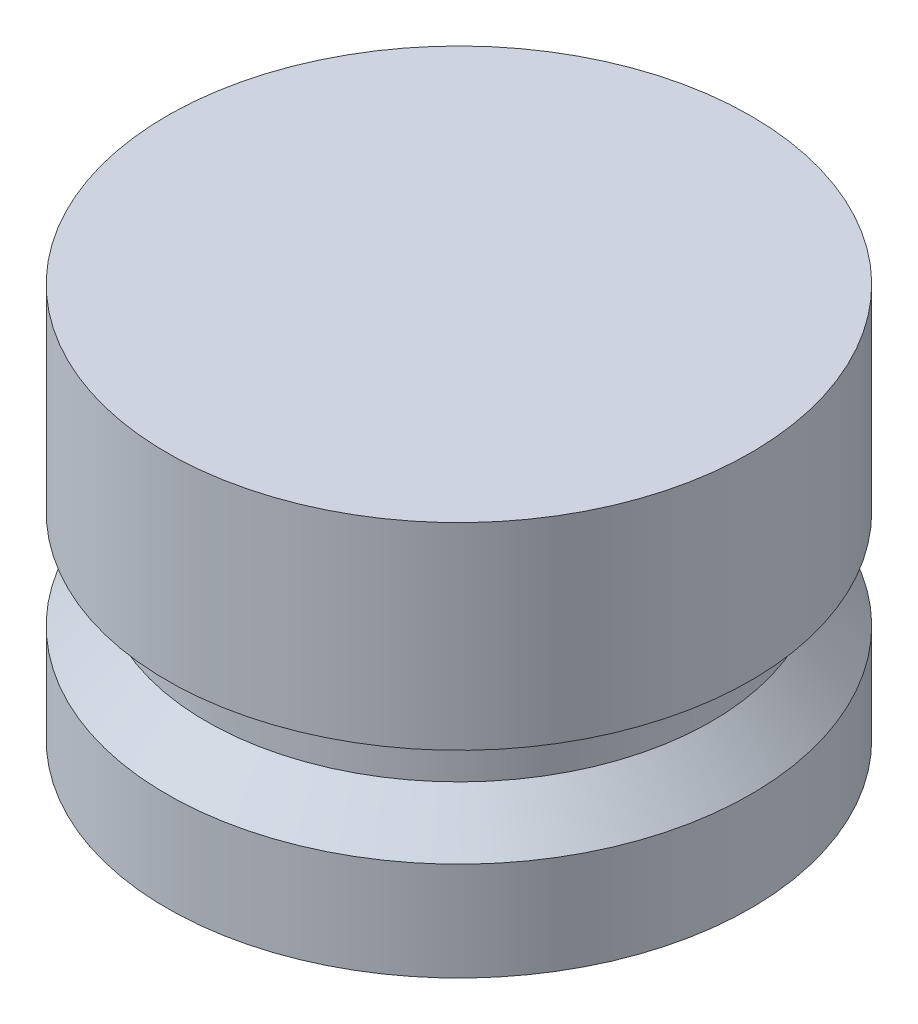
ISO-10303-21;
HEADER;
FILE_DESCRIPTION(('STEP AP214'),'2;1');
FILE_NAME('part.step','',(''),(''),'','','');
FILE_SCHEMA(('AUTOMOTIVE_DESIGN { 1 0 10303 214 1 1 1 1 }'));
ENDSEC;
DATA;
#1=APPLICATION_CONTEXT('core data for automotive mechanical design processes');
#2=APPLICATION_PROTOCOL_DEFINITION('international standard','automotive_design',2000,#1);
#3=PRODUCT_CONTEXT('',#1,'mechanical');
#4=PRODUCT('Part','Part','',(#3));
#5=PRODUCT_RELATED_PRODUCT_CATEGORY('part','',(#4));
#6=PRODUCT_DEFINITION_FORMATION('','',#4);
#7=PRODUCT_DEFINITION_CONTEXT('part definition',#1,'design');
#8=PRODUCT_DEFINITION('design','',#6,#7);
#9=PRODUCT_DEFINITION_SHAPE('','',#8);
#10=(LENGTH_UNIT() NAMED_UNIT(*) SI_UNIT(.MILLI.,.METRE.));
#11=(NAMED_UNIT(*) PLANE_ANGLE_UNIT() SI_UNIT($,.RADIAN.));
#12=(NAMED_UNIT(*) SI_UNIT($,.STERADIAN.) SOLID_ANGLE_UNIT());
#13=UNCERTAINTY_MEASURE_WITH_UNIT(LENGTH_MEASURE(1.E-05),#10,'distance_accuracy_value','');
#14=(GEOMETRIC_REPRESENTATION_CONTEXT(3) GLOBAL_UNCERTAINTY_ASSIGNED_CONTEXT((#13)) GLOBAL_UNIT_ASSIGNED_CONTEXT((#10,
#11,#12)) REPRESENTATION_CONTEXT('',''));
#15=CARTESIAN_POINT('',(0.,0.,0.));
#16=DIRECTION('',(0.,0.,1.));
#17=DIRECTION('',(1.,0.,0.));
#18=AXIS2_PLACEMENT_3D('',#15,#16,#17);
#19=CARTESIAN_POINT('',(0.,0.,0.));
#20=DIRECTION('',(0.,1.,0.));
#21=DIRECTION('',(0.,0.,1.));
#22=AXIS2_PLACEMENT_3D('',#19,#20,#21);
#23=PLANE('',#22);
#24=CARTESIAN_POINT('',(0.,0.,0.));
#25=DIRECTION('',(0.,-1.,0.));
#26=DIRECTION('',(0.,0.,-1.));
#27=AXIS2_PLACEMENT_3D('',#24,#25,#26);
#28=CIRCLE('',#27,9.398);
#29=CARTESIAN_POINT('',(0.,0.,-9.398));
#30=VERTEX_POINT('',#29);
#31=EDGE_CURVE('E10',#30,#30,#28,.T.);
#32=ORIENTED_EDGE('',*,*,#31,.T.);
#33=EDGE_LOOP('',(#32));
#34=FACE_BOUND('',#33,.T.);
#35=ADVANCED_FACE('F31',(#34),#23,.F.);
#36=CARTESIAN_POINT('',(0.,0.,0.));
#37=DIRECTION('',(0.,-1.,0.));
#38=DIRECTION('',(0.,0.,-1.));
#39=AXIS2_PLACEMENT_3D('',#36,#37,#38);
#40=CYLINDRICAL_SURFACE('',#39,9.398);
#41=ORIENTED_EDGE('',*,*,#31,.F.);
#42=EDGE_LOOP('',(#41));
#43=FACE_BOUND('',#42,.T.);
#44=CARTESIAN_POINT('',(0.,3.175,0.));
#45=DIRECTION('',(0.,-1.,0.));
#46=DIRECTION('',(0.,0.,-1.));
#47=AXIS2_PLACEMENT_3D('',#44,#45,#46);
#48=CIRCLE('',#47,9.398);
#49=CARTESIAN_POINT('',(0.,3.175,-9.398));
#50=VERTEX_POINT('',#49);
#51=EDGE_CURVE('E37',#50,#50,#48,.T.);
#52=ORIENTED_EDGE('',*,*,#51,.T.);
#53=EDGE_LOOP('',(#52));
#54=FACE_BOUND('',#53,.T.);
#55=ADVANCED_FACE('F69',(#43,#54),#40,.T.);
#56=CARTESIAN_POINT('',(0.,4.572,0.));
#57=DIRECTION('',(0.,-1.,0.));
#58=DIRECTION('',(0.,0.,-1.));
#59=AXIS2_PLACEMENT_3D('',#56,#57,#58);
#60=CONICAL_SURFACE('',#59,8.128,0.737815060120465);
#61=ORIENTED_EDGE('',*,*,#51,.F.);
#62=EDGE_LOOP('',(#61));
#63=FACE_BOUND('',#62,.T.);
#64=CARTESIAN_POINT('',(0.,4.572,0.));
#65=DIRECTION('',(0.,-1.,0.));
#66=DIRECTION('',(0.,0.,-1.));
#67=AXIS2_PLACEMENT_3D('',#64,#65,#66);
#68=CIRCLE('',#67,8.128);
#69=CARTESIAN_POINT('',(0.,4.572,-8.128));
#70=VERTEX_POINT('',#69);
#71=EDGE_CURVE('E41',#70,#70,#68,.T.);
#72=ORIENTED_EDGE('',*,*,#71,.T.);
#73=EDGE_LOOP('',(#72));
#74=FACE_BOUND('',#73,.T.);
#75=ADVANCED_FACE('F73',(#63,#74),#60,.T.);
#76=CARTESIAN_POINT('',(0.,0.,0.));
#77=DIRECTION('',(0.,-1.,0.));
#78=DIRECTION('',(0.,0.,-1.));
#79=AXIS2_PLACEMENT_3D('',#76,#77,#78);
#80=CYLINDRICAL_SURFACE('',#79,8.128);
#81=ORIENTED_EDGE('',*,*,#71,.F.);
#82=EDGE_LOOP('',(#81));
#83=FACE_BOUND('',#82,.T.);
#84=CARTESIAN_POINT('',(0.,6.35,0.));
#85=DIRECTION('',(0.,-1.,0.));
#86=DIRECTION('',(0.,0.,-1.));
#87=AXIS2_PLACEMENT_3D('',#84,#85,#86);
#88=CIRCLE('',#87,8.128);
#89=CARTESIAN_POINT('',(0.,6.35,-8.128));
#90=VERTEX_POINT('',#89);
#91=EDGE_CURVE('E45',#90,#90,#88,.T.);
#92=ORIENTED_EDGE('',*,*,#91,.T.);
#93=EDGE_LOOP('',(#92));
#94=FACE_BOUND('',#93,.T.);
#95=ADVANCED_FACE('F78',(#83,#94),#80,.T.);
#96=CARTESIAN_POINT('',(-8.128,6.35,0.));
#97=DIRECTION('',(0.,1.,0.));
#98=DIRECTION('',(0.,0.,1.));
#99=AXIS2_PLACEMENT_3D('',#96,#97,#98);
#100=PLANE('',#99);
#101=ORIENTED_EDGE('',*,*,#91,.F.);
#102=EDGE_LOOP('',(#101));
#103=FACE_BOUND('',#102,.T.);
#104=CARTESIAN_POINT('',(0.,6.35,0.));
#105=DIRECTION('',(0.,-1.,0.));
#106=DIRECTION('',(0.,0.,-1.));
#107=AXIS2_PLACEMENT_3D('',#104,#105,#106);
#108=CIRCLE('',#107,9.398);
#109=CARTESIAN_POINT('',(0.,6.35,-9.398));
#110=VERTEX_POINT('',#109);
#111=EDGE_CURVE('E50',#110,#110,#108,.T.);
#112=ORIENTED_EDGE('',*,*,#111,.T.);
#113=EDGE_LOOP('',(#112));
#114=FACE_BOUND('',#113,.T.);
#115=ADVANCED_FACE('F65',(#103,#114),#100,.F.);
#116=CARTESIAN_POINT('',(0.,0.,0.));
#117=DIRECTION('',(0.,-1.,0.));
#118=DIRECTION('',(0.,0.,-1.));
#119=AXIS2_PLACEMENT_3D('',#116,#117,#118);
#120=CYLINDRICAL_SURFACE('',#119,9.398);
#121=ORIENTED_EDGE('',*,*,#111,.F.);
#122=EDGE_LOOP('',(#121));
#123=FACE_BOUND('',#122,.T.);
#124=CARTESIAN_POINT('',(0.,12.7,0.));
#125=DIRECTION('',(0.,-1.,0.));
#126=DIRECTION('',(0.,0.,-1.));
#127=AXIS2_PLACEMENT_3D('',#124,#125,#126);
#128=CIRCLE('',#127,9.398);
#129=CARTESIAN_POINT('',(0.,12.7,-9.398));
#130=VERTEX_POINT('',#129);
#131=EDGE_CURVE('E53',#130,#130,#128,.T.);
#132=ORIENTED_EDGE('',*,*,#131,.T.);
#133=EDGE_LOOP('',(#132));
#134=FACE_BOUND('',#133,.T.);
#135=ADVANCED_FACE('F57',(#123,#134),#120,.T.);
#136=CARTESIAN_POINT('',(-9.398,12.7,0.));
#137=DIRECTION('',(0.,-1.,0.));
#138=DIRECTION('',(0.,0.,-1.));
#139=AXIS2_PLACEMENT_3D('',#136,#137,#138);
#140=PLANE('',#139);
#141=ORIENTED_EDGE('',*,*,#131,.F.);
#142=EDGE_LOOP('',(#141));
#143=FACE_BOUND('',#142,.T.);
#144=ADVANCED_FACE('F59',(#143),#140,.F.);
#145=CLOSED_SHELL('',(#35,#55,#75,#95,#115,#135,#144));
#146=MANIFOLD_SOLID_BREP('B2',#145);
#147=ADVANCED_BREP_SHAPE_REPRESENTATION('',(#18,#146),#14);
#148=SHAPE_DEFINITION_REPRESENTATION(#9,#147);
ENDSEC;
END-ISO-10303-21;
